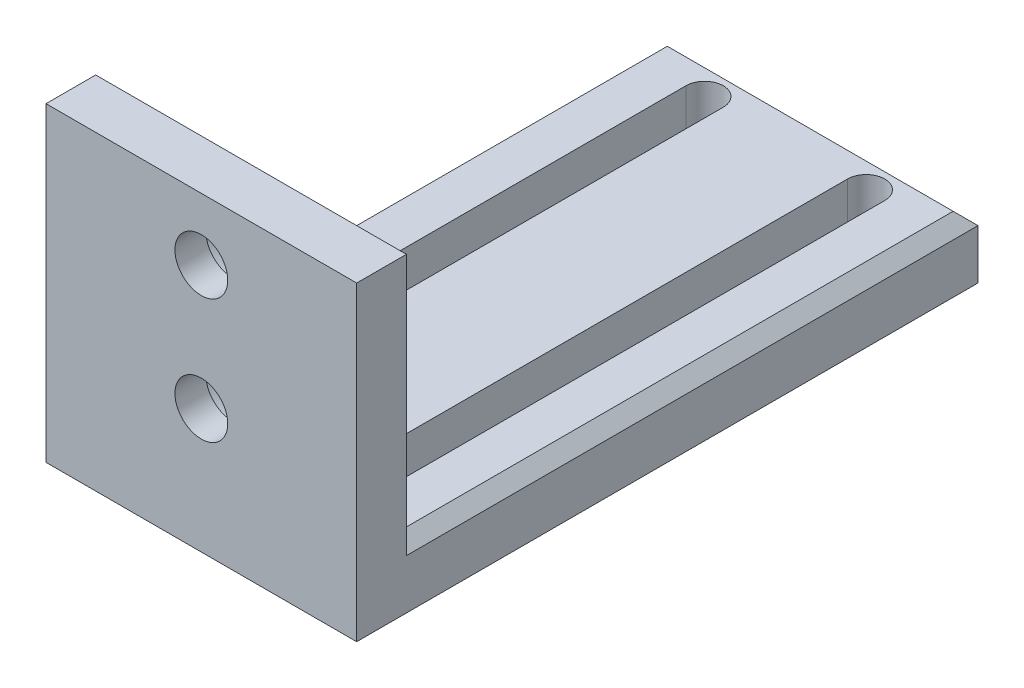
ISO-10303-21;
HEADER;
FILE_DESCRIPTION(('STEP AP214'),'2;1');
FILE_NAME('part.step','',(''),(''),'','','');
FILE_SCHEMA(('AUTOMOTIVE_DESIGN { 1 0 10303 214 1 1 1 1 }'));
ENDSEC;
DATA;
#1=APPLICATION_CONTEXT('core data for automotive mechanical design processes');
#2=APPLICATION_PROTOCOL_DEFINITION('international standard','automotive_design',2000,#1);
#3=PRODUCT_CONTEXT('',#1,'mechanical');
#4=PRODUCT('Part','Part','',(#3));
#5=PRODUCT_RELATED_PRODUCT_CATEGORY('part','',(#4));
#6=PRODUCT_DEFINITION_FORMATION('','',#4);
#7=PRODUCT_DEFINITION_CONTEXT('part definition',#1,'design');
#8=PRODUCT_DEFINITION('design','',#6,#7);
#9=PRODUCT_DEFINITION_SHAPE('','',#8);
#10=(LENGTH_UNIT() NAMED_UNIT(*) SI_UNIT(.MILLI.,.METRE.));
#11=(NAMED_UNIT(*) PLANE_ANGLE_UNIT() SI_UNIT($,.RADIAN.));
#12=(NAMED_UNIT(*) SI_UNIT($,.STERADIAN.) SOLID_ANGLE_UNIT());
#13=UNCERTAINTY_MEASURE_WITH_UNIT(LENGTH_MEASURE(1.E-05),#10,'distance_accuracy_value','');
#14=(GEOMETRIC_REPRESENTATION_CONTEXT(3) GLOBAL_UNCERTAINTY_ASSIGNED_CONTEXT((#13)) GLOBAL_UNIT_ASSIGNED_CONTEXT((#10,
#11,#12)) REPRESENTATION_CONTEXT('',''));
#15=CARTESIAN_POINT('',(0.,0.,0.));
#16=DIRECTION('',(0.,0.,1.));
#17=DIRECTION('',(1.,0.,0.));
#18=AXIS2_PLACEMENT_3D('',#15,#16,#17);
#19=CARTESIAN_POINT('',(25.,40.,10.));
#20=DIRECTION('',(0.,0.,-1.));
#21=DIRECTION('',(-1.,0.,0.));
#22=AXIS2_PLACEMENT_3D('',#19,#20,#21);
#23=CYLINDRICAL_SURFACE('',#22,4.25);
#24=CARTESIAN_POINT('',(25.,40.,10.));
#25=DIRECTION('',(0.,0.,1.));
#26=DIRECTION('',(1.,0.,0.));
#27=AXIS2_PLACEMENT_3D('',#24,#25,#26);
#28=CIRCLE('',#27,4.25);
#29=CARTESIAN_POINT('',(29.25,40.,10.));
#30=VERTEX_POINT('',#29);
#31=EDGE_CURVE('E194',#30,#30,#28,.T.);
#32=ORIENTED_EDGE('',*,*,#31,.T.);
#33=EDGE_LOOP('',(#32));
#34=FACE_BOUND('',#33,.T.);
#35=CARTESIAN_POINT('',(25.,40.,5.));
#36=DIRECTION('',(0.,0.,-1.));
#37=DIRECTION('',(-1.,0.,0.));
#38=AXIS2_PLACEMENT_3D('',#35,#36,#37);
#39=CIRCLE('',#38,4.25);
#40=CARTESIAN_POINT('',(20.75,40.,5.));
#41=VERTEX_POINT('',#40);
#42=EDGE_CURVE('E315',#41,#41,#39,.T.);
#43=ORIENTED_EDGE('',*,*,#42,.T.);
#44=EDGE_LOOP('',(#43));
#45=FACE_BOUND('',#44,.T.);
#46=ADVANCED_FACE('F43',(#34,#45),#23,.F.);
#47=CARTESIAN_POINT('',(25.,20.,10.));
#48=DIRECTION('',(0.,0.,-1.));
#49=DIRECTION('',(-1.,0.,0.));
#50=AXIS2_PLACEMENT_3D('',#47,#48,#49);
#51=CYLINDRICAL_SURFACE('',#50,4.25);
#52=CARTESIAN_POINT('',(25.,20.,10.));
#53=DIRECTION('',(0.,0.,1.));
#54=DIRECTION('',(1.,0.,0.));
#55=AXIS2_PLACEMENT_3D('',#52,#53,#54);
#56=CIRCLE('',#55,4.25);
#57=CARTESIAN_POINT('',(29.25,20.,10.));
#58=VERTEX_POINT('',#57);
#59=EDGE_CURVE('E320',#58,#58,#56,.T.);
#60=ORIENTED_EDGE('',*,*,#59,.T.);
#61=EDGE_LOOP('',(#60));
#62=FACE_BOUND('',#61,.T.);
#63=CARTESIAN_POINT('',(25.,20.,5.));
#64=DIRECTION('',(0.,0.,-1.));
#65=DIRECTION('',(-1.,0.,0.));
#66=AXIS2_PLACEMENT_3D('',#63,#64,#65);
#67=CIRCLE('',#66,4.25);
#68=CARTESIAN_POINT('',(20.75,20.,5.));
#69=VERTEX_POINT('',#68);
#70=EDGE_CURVE('E311',#69,#69,#67,.T.);
#71=ORIENTED_EDGE('',*,*,#70,.T.);
#72=EDGE_LOOP('',(#71));
#73=FACE_BOUND('',#72,.T.);
#74=ADVANCED_FACE('F460',(#62,#73),#51,.F.);
#75=CARTESIAN_POINT('',(0.,10.,0.));
#76=DIRECTION('',(0.,-1.,0.));
#77=DIRECTION('',(0.,0.,-1.));
#78=AXIS2_PLACEMENT_3D('',#75,#76,#77);
#79=PLANE('',#78);
#80=CARTESIAN_POINT('',(12.,10.,-6.));
#81=DIRECTION('',(0.,1.,0.));
#82=DIRECTION('',(0.,0.,1.));
#83=AXIS2_PLACEMENT_3D('',#80,#81,#82);
#84=CIRCLE('',#83,3.);
#85=CARTESIAN_POINT('',(9.,10.,-6.));
#86=VERTEX_POINT('',#85);
#87=CARTESIAN_POINT('',(15.,10.,-6.));
#88=VERTEX_POINT('',#87);
#89=EDGE_CURVE('E249',#86,#88,#84,.T.);
#90=ORIENTED_EDGE('',*,*,#89,.F.);
#91=DIRECTION('',(0.,0.,1.));
#92=VECTOR('',#91,1.);
#93=CARTESIAN_POINT('',(9.,10.,-6.));
#94=LINE('',#93,#92);
#95=CARTESIAN_POINT('',(9.,10.,-84.));
#96=VERTEX_POINT('',#95);
#97=EDGE_CURVE('E260',#96,#86,#94,.T.);
#98=ORIENTED_EDGE('',*,*,#97,.F.);
#99=CARTESIAN_POINT('',(12.,10.,-84.));
#100=DIRECTION('',(0.,1.,0.));
#101=DIRECTION('',(0.,0.,1.));
#102=AXIS2_PLACEMENT_3D('',#99,#100,#101);
#103=CIRCLE('',#102,3.);
#104=CARTESIAN_POINT('',(15.,10.,-84.));
#105=VERTEX_POINT('',#104);
#106=EDGE_CURVE('E256',#105,#96,#103,.T.);
#107=ORIENTED_EDGE('',*,*,#106,.F.);
#108=DIRECTION('',(0.,0.,-1.));
#109=VECTOR('',#108,1.);
#110=CARTESIAN_POINT('',(15.,10.,-6.));
#111=LINE('',#110,#109);
#112=EDGE_CURVE('E252',#88,#105,#111,.T.);
#113=ORIENTED_EDGE('',*,*,#112,.F.);
#114=EDGE_LOOP('',(#90,#98,#107,#113));
#115=FACE_BOUND('',#114,.T.);
#116=DIRECTION('',(1.,0.,0.));
#117=VECTOR('',#116,1.);
#118=CARTESIAN_POINT('',(0.,10.,0.));
#119=LINE('',#118,#117);
#120=CARTESIAN_POINT('',(2.,10.,0.));
#121=VERTEX_POINT('',#120);
#122=CARTESIAN_POINT('',(48.,10.,0.));
#123=VERTEX_POINT('',#122);
#124=EDGE_CURVE('E292',#121,#123,#119,.T.);
#125=ORIENTED_EDGE('',*,*,#124,.T.);
#126=DIRECTION('',(0.,0.,-1.));
#127=VECTOR('',#126,1.);
#128=CARTESIAN_POINT('',(48.,10.,0.));
#129=LINE('',#128,#127);
#130=CARTESIAN_POINT('',(48.,10.,-88.));
#131=VERTEX_POINT('',#130);
#132=EDGE_CURVE('E54',#123,#131,#129,.T.);
#133=ORIENTED_EDGE('',*,*,#132,.T.);
#134=DIRECTION('',(-1.,0.,0.));
#135=VECTOR('',#134,1.);
#136=CARTESIAN_POINT('',(0.,10.,-88.));
#137=LINE('',#136,#135);
#138=CARTESIAN_POINT('',(2.,10.,-88.));
#139=VERTEX_POINT('',#138);
#140=EDGE_CURVE('E66',#131,#139,#137,.T.);
#141=ORIENTED_EDGE('',*,*,#140,.T.);
#142=DIRECTION('',(0.,0.,1.));
#143=VECTOR('',#142,1.);
#144=CARTESIAN_POINT('',(2.,10.,0.));
#145=LINE('',#144,#143);
#146=EDGE_CURVE('E351',#139,#121,#145,.T.);
#147=ORIENTED_EDGE('',*,*,#146,.T.);
#148=EDGE_LOOP('',(#125,#133,#141,#147));
#149=FACE_BOUND('',#148,.T.);
#150=CARTESIAN_POINT('',(38.,10.,-6.00000000000001));
#151=DIRECTION('',(0.,1.,0.));
#152=DIRECTION('',(0.,0.,1.));
#153=AXIS2_PLACEMENT_3D('',#150,#151,#152);
#154=CIRCLE('',#153,3.);
#155=CARTESIAN_POINT('',(35.,10.,-6.00000000000001));
#156=VERTEX_POINT('',#155);
#157=CARTESIAN_POINT('',(41.,10.,-6.00000000000001));
#158=VERTEX_POINT('',#157);
#159=EDGE_CURVE('E210',#156,#158,#154,.T.);
#160=ORIENTED_EDGE('',*,*,#159,.F.);
#161=DIRECTION('',(0.,0.,1.));
#162=VECTOR('',#161,1.);
#163=CARTESIAN_POINT('',(35.,10.,-6.00000000000001));
#164=LINE('',#163,#162);
#165=CARTESIAN_POINT('',(35.,10.,-84.));
#166=VERTEX_POINT('',#165);
#167=EDGE_CURVE('E221',#166,#156,#164,.T.);
#168=ORIENTED_EDGE('',*,*,#167,.F.);
#169=CARTESIAN_POINT('',(38.,10.,-84.));
#170=DIRECTION('',(0.,1.,0.));
#171=DIRECTION('',(0.,0.,1.));
#172=AXIS2_PLACEMENT_3D('',#169,#170,#171);
#173=CIRCLE('',#172,3.);
#174=CARTESIAN_POINT('',(41.,10.,-84.));
#175=VERTEX_POINT('',#174);
#176=EDGE_CURVE('E217',#175,#166,#173,.T.);
#177=ORIENTED_EDGE('',*,*,#176,.F.);
#178=DIRECTION('',(0.,0.,-1.));
#179=VECTOR('',#178,1.);
#180=CARTESIAN_POINT('',(41.,10.,-6.00000000000001));
#181=LINE('',#180,#179);
#182=EDGE_CURVE('E213',#158,#175,#181,.T.);
#183=ORIENTED_EDGE('',*,*,#182,.F.);
#184=EDGE_LOOP('',(#160,#168,#177,#183));
#185=FACE_BOUND('',#184,.T.);
#186=ADVANCED_FACE('F440',(#115,#149,#185),#79,.F.);
#187=CARTESIAN_POINT('',(0.,0.,0.));
#188=DIRECTION('',(0.,-1.,0.));
#189=DIRECTION('',(0.,0.,-1.));
#190=AXIS2_PLACEMENT_3D('',#187,#188,#189);
#191=PLANE('',#190);
#192=DIRECTION('',(0.,0.,1.));
#193=VECTOR('',#192,1.);
#194=CARTESIAN_POINT('',(0.,0.,0.));
#195=LINE('',#194,#193);
#196=CARTESIAN_POINT('',(0.,0.,-90.));
#197=VERTEX_POINT('',#196);
#198=CARTESIAN_POINT('',(0.,0.,10.));
#199=VERTEX_POINT('',#198);
#200=EDGE_CURVE('E291',#197,#199,#195,.T.);
#201=ORIENTED_EDGE('',*,*,#200,.F.);
#202=DIRECTION('',(-1.,0.,0.));
#203=VECTOR('',#202,1.);
#204=CARTESIAN_POINT('',(0.,0.,-90.));
#205=LINE('',#204,#203);
#206=CARTESIAN_POINT('',(50.,0.,-90.));
#207=VERTEX_POINT('',#206);
#208=EDGE_CURVE('E296',#207,#197,#205,.T.);
#209=ORIENTED_EDGE('',*,*,#208,.F.);
#210=DIRECTION('',(0.,0.,-1.));
#211=VECTOR('',#210,1.);
#212=CARTESIAN_POINT('',(50.,0.,0.));
#213=LINE('',#212,#211);
#214=CARTESIAN_POINT('',(50.,0.,10.));
#215=VERTEX_POINT('',#214);
#216=EDGE_CURVE('E299',#215,#207,#213,.T.);
#217=ORIENTED_EDGE('',*,*,#216,.F.);
#218=DIRECTION('',(1.,0.,0.));
#219=VECTOR('',#218,1.);
#220=CARTESIAN_POINT('',(50.,0.,10.));
#221=LINE('',#220,#219);
#222=EDGE_CURVE('E190',#199,#215,#221,.T.);
#223=ORIENTED_EDGE('',*,*,#222,.F.);
#224=EDGE_LOOP('',(#201,#209,#217,#223));
#225=FACE_BOUND('',#224,.T.);
#226=DIRECTION('',(0.,0.,1.));
#227=VECTOR('',#226,1.);
#228=CARTESIAN_POINT('',(9.,0.,-6.));
#229=LINE('',#228,#227);
#230=CARTESIAN_POINT('',(9.,0.,-84.));
#231=VERTEX_POINT('',#230);
#232=CARTESIAN_POINT('',(9.,0.,-6.));
#233=VERTEX_POINT('',#232);
#234=EDGE_CURVE('E253',#231,#233,#229,.T.);
#235=ORIENTED_EDGE('',*,*,#234,.T.);
#236=CARTESIAN_POINT('',(12.,0.,-6.));
#237=DIRECTION('',(0.,1.,0.));
#238=DIRECTION('',(0.,0.,1.));
#239=AXIS2_PLACEMENT_3D('',#236,#237,#238);
#240=CIRCLE('',#239,3.);
#241=CARTESIAN_POINT('',(15.,0.,-6.));
#242=VERTEX_POINT('',#241);
#243=EDGE_CURVE('E248',#233,#242,#240,.T.);
#244=ORIENTED_EDGE('',*,*,#243,.T.);
#245=DIRECTION('',(0.,0.,-1.));
#246=VECTOR('',#245,1.);
#247=CARTESIAN_POINT('',(15.,0.,-6.));
#248=LINE('',#247,#246);
#249=CARTESIAN_POINT('',(15.,0.,-84.));
#250=VERTEX_POINT('',#249);
#251=EDGE_CURVE('E267',#242,#250,#248,.T.);
#252=ORIENTED_EDGE('',*,*,#251,.T.);
#253=CARTESIAN_POINT('',(12.,0.,-84.));
#254=DIRECTION('',(0.,1.,0.));
#255=DIRECTION('',(0.,0.,1.));
#256=AXIS2_PLACEMENT_3D('',#253,#254,#255);
#257=CIRCLE('',#256,3.);
#258=EDGE_CURVE('E271',#250,#231,#257,.T.);
#259=ORIENTED_EDGE('',*,*,#258,.T.);
#260=EDGE_LOOP('',(#235,#244,#252,#259));
#261=FACE_BOUND('',#260,.T.);
#262=DIRECTION('',(0.,0.,1.));
#263=VECTOR('',#262,1.);
#264=CARTESIAN_POINT('',(35.,0.,-6.00000000000001));
#265=LINE('',#264,#263);
#266=CARTESIAN_POINT('',(35.,0.,-84.));
#267=VERTEX_POINT('',#266);
#268=CARTESIAN_POINT('',(35.,0.,-6.00000000000001));
#269=VERTEX_POINT('',#268);
#270=EDGE_CURVE('E214',#267,#269,#265,.T.);
#271=ORIENTED_EDGE('',*,*,#270,.T.);
#272=CARTESIAN_POINT('',(38.,0.,-6.00000000000001));
#273=DIRECTION('',(0.,1.,0.));
#274=DIRECTION('',(0.,0.,1.));
#275=AXIS2_PLACEMENT_3D('',#272,#273,#274);
#276=CIRCLE('',#275,3.);
#277=CARTESIAN_POINT('',(41.,0.,-6.00000000000001));
#278=VERTEX_POINT('',#277);
#279=EDGE_CURVE('E200',#269,#278,#276,.T.);
#280=ORIENTED_EDGE('',*,*,#279,.T.);
#281=DIRECTION('',(0.,0.,-1.));
#282=VECTOR('',#281,1.);
#283=CARTESIAN_POINT('',(41.,0.,-6.00000000000001));
#284=LINE('',#283,#282);
#285=CARTESIAN_POINT('',(41.,0.,-84.));
#286=VERTEX_POINT('',#285);
#287=EDGE_CURVE('E205',#278,#286,#284,.T.);
#288=ORIENTED_EDGE('',*,*,#287,.T.);
#289=CARTESIAN_POINT('',(38.,0.,-84.));
#290=DIRECTION('',(0.,1.,0.));
#291=DIRECTION('',(0.,0.,1.));
#292=AXIS2_PLACEMENT_3D('',#289,#290,#291);
#293=CIRCLE('',#292,3.);
#294=EDGE_CURVE('E228',#286,#267,#293,.T.);
#295=ORIENTED_EDGE('',*,*,#294,.T.);
#296=EDGE_LOOP('',(#271,#280,#288,#295));
#297=FACE_BOUND('',#296,.T.);
#298=ADVANCED_FACE('F427',(#225,#261,#297),#191,.T.);
#299=CARTESIAN_POINT('',(0.,10.,0.));
#300=DIRECTION('',(1.,0.,0.));
#301=DIRECTION('',(0.,0.,-1.));
#302=AXIS2_PLACEMENT_3D('',#299,#300,#301);
#303=PLANE('',#302);
#304=DIRECTION('',(0.,0.,-1.));
#305=VECTOR('',#304,1.);
#306=CARTESIAN_POINT('',(0.,50.,10.));
#307=LINE('',#306,#305);
#308=CARTESIAN_POINT('',(0.,50.,10.));
#309=VERTEX_POINT('',#308);
#310=CARTESIAN_POINT('',(0.,50.,2.));
#311=VERTEX_POINT('',#310);
#312=EDGE_CURVE('E177',#309,#311,#307,.T.);
#313=ORIENTED_EDGE('',*,*,#312,.T.);
#314=DIRECTION('',(0.,-1.,0.));
#315=VECTOR('',#314,1.);
#316=CARTESIAN_POINT('',(0.,10.,2.00000000000003));
#317=LINE('',#316,#315);
#318=CARTESIAN_POINT('',(0.,7.99999999999997,2.00000000000003));
#319=VERTEX_POINT('',#318);
#320=EDGE_CURVE('E323',#311,#319,#317,.T.);
#321=ORIENTED_EDGE('',*,*,#320,.T.);
#322=DIRECTION('',(0.,0.,-1.));
#323=VECTOR('',#322,1.);
#324=CARTESIAN_POINT('',(0.,7.99999999999997,0.));
#325=LINE('',#324,#323);
#326=CARTESIAN_POINT('',(0.,7.99999999999997,-90.));
#327=VERTEX_POINT('',#326);
#328=EDGE_CURVE('E310',#319,#327,#325,.T.);
#329=ORIENTED_EDGE('',*,*,#328,.T.);
#330=DIRECTION('',(0.,-1.,0.));
#331=VECTOR('',#330,1.);
#332=CARTESIAN_POINT('',(0.,10.,-90.));
#333=LINE('',#332,#331);
#334=EDGE_CURVE('E295',#327,#197,#333,.T.);
#335=ORIENTED_EDGE('',*,*,#334,.T.);
#336=ORIENTED_EDGE('',*,*,#200,.T.);
#337=DIRECTION('',(0.,-1.,0.));
#338=VECTOR('',#337,1.);
#339=CARTESIAN_POINT('',(0.,0.,10.));
#340=LINE('',#339,#338);
#341=EDGE_CURVE('E182',#309,#199,#340,.T.);
#342=ORIENTED_EDGE('',*,*,#341,.F.);
#343=EDGE_LOOP('',(#313,#321,#329,#335,#336,#342));
#344=FACE_BOUND('',#343,.T.);
#345=ADVANCED_FACE('F424',(#344),#303,.F.);
#346=CARTESIAN_POINT('',(50.,10.,0.));
#347=DIRECTION('',(-1.,0.,0.));
#348=DIRECTION('',(0.,0.,1.));
#349=AXIS2_PLACEMENT_3D('',#346,#347,#348);
#350=PLANE('',#349);
#351=DIRECTION('',(0.,0.,1.));
#352=VECTOR('',#351,1.);
#353=CARTESIAN_POINT('',(50.,7.99999999999997,0.));
#354=LINE('',#353,#352);
#355=CARTESIAN_POINT('',(50.,7.99999999999997,-90.));
#356=VERTEX_POINT('',#355);
#357=CARTESIAN_POINT('',(50.,7.99999999999997,2.));
#358=VERTEX_POINT('',#357);
#359=EDGE_CURVE('E346',#356,#358,#354,.T.);
#360=ORIENTED_EDGE('',*,*,#359,.T.);
#361=DIRECTION('',(0.,1.,0.));
#362=VECTOR('',#361,1.);
#363=CARTESIAN_POINT('',(50.,10.,2.));
#364=LINE('',#363,#362);
#365=CARTESIAN_POINT('',(50.,50.,2.));
#366=VERTEX_POINT('',#365);
#367=EDGE_CURVE('E198',#358,#366,#364,.T.);
#368=ORIENTED_EDGE('',*,*,#367,.T.);
#369=DIRECTION('',(0.,0.,-1.));
#370=VECTOR('',#369,1.);
#371=CARTESIAN_POINT('',(50.,50.,10.));
#372=LINE('',#371,#370);
#373=CARTESIAN_POINT('',(50.,50.,10.));
#374=VERTEX_POINT('',#373);
#375=EDGE_CURVE('E174',#374,#366,#372,.T.);
#376=ORIENTED_EDGE('',*,*,#375,.F.);
#377=DIRECTION('',(0.,1.,0.));
#378=VECTOR('',#377,1.);
#379=CARTESIAN_POINT('',(50.,0.,10.));
#380=LINE('',#379,#378);
#381=EDGE_CURVE('E183',#215,#374,#380,.T.);
#382=ORIENTED_EDGE('',*,*,#381,.F.);
#383=ORIENTED_EDGE('',*,*,#216,.T.);
#384=DIRECTION('',(0.,-1.,0.));
#385=VECTOR('',#384,1.);
#386=CARTESIAN_POINT('',(50.,10.,-90.));
#387=LINE('',#386,#385);
#388=EDGE_CURVE('E307',#356,#207,#387,.T.);
#389=ORIENTED_EDGE('',*,*,#388,.F.);
#390=EDGE_LOOP('',(#360,#368,#376,#382,#383,#389));
#391=FACE_BOUND('',#390,.T.);
#392=ADVANCED_FACE('F196',(#391),#350,.F.);
#393=CARTESIAN_POINT('',(0.,10.,-90.));
#394=DIRECTION('',(0.,0.,1.));
#395=DIRECTION('',(1.,0.,0.));
#396=AXIS2_PLACEMENT_3D('',#393,#394,#395);
#397=PLANE('',#396);
#398=ORIENTED_EDGE('',*,*,#334,.F.);
#399=DIRECTION('',(1.,0.,0.));
#400=VECTOR('',#399,1.);
#401=CARTESIAN_POINT('',(0.,7.99999999999997,-90.));
#402=LINE('',#401,#400);
#403=EDGE_CURVE('E11',#327,#356,#402,.T.);
#404=ORIENTED_EDGE('',*,*,#403,.T.);
#405=ORIENTED_EDGE('',*,*,#388,.T.);
#406=ORIENTED_EDGE('',*,*,#208,.T.);
#407=EDGE_LOOP('',(#398,#404,#405,#406));
#408=FACE_BOUND('',#407,.T.);
#409=ADVANCED_FACE('F446',(#408),#397,.F.);
#410=CARTESIAN_POINT('',(12.,10.,-6.));
#411=DIRECTION('',(0.,-1.,0.));
#412=DIRECTION('',(0.,0.,-1.));
#413=AXIS2_PLACEMENT_3D('',#410,#411,#412);
#414=CYLINDRICAL_SURFACE('',#413,3.);
#415=ORIENTED_EDGE('',*,*,#243,.F.);
#416=DIRECTION('',(0.,-1.,0.));
#417=VECTOR('',#416,1.);
#418=CARTESIAN_POINT('',(9.,10.,-6.));
#419=LINE('',#418,#417);
#420=EDGE_CURVE('E263',#86,#233,#419,.T.);
#421=ORIENTED_EDGE('',*,*,#420,.F.);
#422=ORIENTED_EDGE('',*,*,#89,.T.);
#423=DIRECTION('',(0.,-1.,0.));
#424=VECTOR('',#423,1.);
#425=CARTESIAN_POINT('',(15.,10.,-6.));
#426=LINE('',#425,#424);
#427=EDGE_CURVE('E287',#88,#242,#426,.T.);
#428=ORIENTED_EDGE('',*,*,#427,.T.);
#429=EDGE_LOOP('',(#415,#421,#422,#428));
#430=FACE_BOUND('',#429,.T.);
#431=ADVANCED_FACE('F448',(#430),#414,.F.);
#432=CARTESIAN_POINT('',(15.,10.,-6.));
#433=DIRECTION('',(-1.,0.,0.));
#434=DIRECTION('',(0.,0.,1.));
#435=AXIS2_PLACEMENT_3D('',#432,#433,#434);
#436=PLANE('',#435);
#437=ORIENTED_EDGE('',*,*,#251,.F.);
#438=ORIENTED_EDGE('',*,*,#427,.F.);
#439=ORIENTED_EDGE('',*,*,#112,.T.);
#440=DIRECTION('',(0.,-1.,0.));
#441=VECTOR('',#440,1.);
#442=CARTESIAN_POINT('',(15.,10.,-84.));
#443=LINE('',#442,#441);
#444=EDGE_CURVE('E284',#105,#250,#443,.T.);
#445=ORIENTED_EDGE('',*,*,#444,.T.);
#446=EDGE_LOOP('',(#437,#438,#439,#445));
#447=FACE_BOUND('',#446,.T.);
#448=ADVANCED_FACE('F454',(#447),#436,.T.);
#449=CARTESIAN_POINT('',(12.,10.,-84.));
#450=DIRECTION('',(0.,-1.,0.));
#451=DIRECTION('',(0.,0.,-1.));
#452=AXIS2_PLACEMENT_3D('',#449,#450,#451);
#453=CYLINDRICAL_SURFACE('',#452,3.);
#454=ORIENTED_EDGE('',*,*,#258,.F.);
#455=ORIENTED_EDGE('',*,*,#444,.F.);
#456=ORIENTED_EDGE('',*,*,#106,.T.);
#457=DIRECTION('',(0.,-1.,0.));
#458=VECTOR('',#457,1.);
#459=CARTESIAN_POINT('',(9.,10.,-84.));
#460=LINE('',#459,#458);
#461=EDGE_CURVE('E281',#96,#231,#460,.T.);
#462=ORIENTED_EDGE('',*,*,#461,.T.);
#463=EDGE_LOOP('',(#454,#455,#456,#462));
#464=FACE_BOUND('',#463,.T.);
#465=ADVANCED_FACE('F498',(#464),#453,.F.);
#466=CARTESIAN_POINT('',(9.,10.,-6.));
#467=DIRECTION('',(1.,0.,0.));
#468=DIRECTION('',(0.,0.,-1.));
#469=AXIS2_PLACEMENT_3D('',#466,#467,#468);
#470=PLANE('',#469);
#471=ORIENTED_EDGE('',*,*,#234,.F.);
#472=ORIENTED_EDGE('',*,*,#461,.F.);
#473=ORIENTED_EDGE('',*,*,#97,.T.);
#474=ORIENTED_EDGE('',*,*,#420,.T.);
#475=EDGE_LOOP('',(#471,#472,#473,#474));
#476=FACE_BOUND('',#475,.T.);
#477=ADVANCED_FACE('F494',(#476),#470,.T.);
#478=CARTESIAN_POINT('',(38.,10.,-6.00000000000001));
#479=DIRECTION('',(0.,-1.,0.));
#480=DIRECTION('',(0.,0.,-1.));
#481=AXIS2_PLACEMENT_3D('',#478,#479,#480);
#482=CYLINDRICAL_SURFACE('',#481,3.);
#483=ORIENTED_EDGE('',*,*,#279,.F.);
#484=DIRECTION('',(0.,-1.,0.));
#485=VECTOR('',#484,1.);
#486=CARTESIAN_POINT('',(35.,10.,-6.00000000000001));
#487=LINE('',#486,#485);
#488=EDGE_CURVE('E223',#156,#269,#487,.T.);
#489=ORIENTED_EDGE('',*,*,#488,.F.);
#490=ORIENTED_EDGE('',*,*,#159,.T.);
#491=DIRECTION('',(0.,-1.,0.));
#492=VECTOR('',#491,1.);
#493=CARTESIAN_POINT('',(41.,10.,-6.00000000000001));
#494=LINE('',#493,#492);
#495=EDGE_CURVE('E244',#158,#278,#494,.T.);
#496=ORIENTED_EDGE('',*,*,#495,.T.);
#497=EDGE_LOOP('',(#483,#489,#490,#496));
#498=FACE_BOUND('',#497,.T.);
#499=ADVANCED_FACE('F490',(#498),#482,.F.);
#500=CARTESIAN_POINT('',(41.,10.,-6.00000000000001));
#501=DIRECTION('',(-1.,0.,0.));
#502=DIRECTION('',(0.,0.,1.));
#503=AXIS2_PLACEMENT_3D('',#500,#501,#502);
#504=PLANE('',#503);
#505=ORIENTED_EDGE('',*,*,#287,.F.);
#506=ORIENTED_EDGE('',*,*,#495,.F.);
#507=ORIENTED_EDGE('',*,*,#182,.T.);
#508=DIRECTION('',(0.,-1.,0.));
#509=VECTOR('',#508,1.);
#510=CARTESIAN_POINT('',(41.,10.,-84.));
#511=LINE('',#510,#509);
#512=EDGE_CURVE('E241',#175,#286,#511,.T.);
#513=ORIENTED_EDGE('',*,*,#512,.T.);
#514=EDGE_LOOP('',(#505,#506,#507,#513));
#515=FACE_BOUND('',#514,.T.);
#516=ADVANCED_FACE('F486',(#515),#504,.T.);
#517=CARTESIAN_POINT('',(38.,10.,-84.));
#518=DIRECTION('',(0.,-1.,0.));
#519=DIRECTION('',(0.,0.,-1.));
#520=AXIS2_PLACEMENT_3D('',#517,#518,#519);
#521=CYLINDRICAL_SURFACE('',#520,3.);
#522=ORIENTED_EDGE('',*,*,#294,.F.);
#523=ORIENTED_EDGE('',*,*,#512,.F.);
#524=ORIENTED_EDGE('',*,*,#176,.T.);
#525=DIRECTION('',(0.,-1.,0.));
#526=VECTOR('',#525,1.);
#527=CARTESIAN_POINT('',(35.,10.,-84.));
#528=LINE('',#527,#526);
#529=EDGE_CURVE('E238',#166,#267,#528,.T.);
#530=ORIENTED_EDGE('',*,*,#529,.T.);
#531=EDGE_LOOP('',(#522,#523,#524,#530));
#532=FACE_BOUND('',#531,.T.);
#533=ADVANCED_FACE('F482',(#532),#521,.F.);
#534=CARTESIAN_POINT('',(35.,10.,-6.00000000000001));
#535=DIRECTION('',(1.,0.,0.));
#536=DIRECTION('',(0.,0.,-1.));
#537=AXIS2_PLACEMENT_3D('',#534,#535,#536);
#538=PLANE('',#537);
#539=ORIENTED_EDGE('',*,*,#270,.F.);
#540=ORIENTED_EDGE('',*,*,#529,.F.);
#541=ORIENTED_EDGE('',*,*,#167,.T.);
#542=ORIENTED_EDGE('',*,*,#488,.T.);
#543=EDGE_LOOP('',(#539,#540,#541,#542));
#544=FACE_BOUND('',#543,.T.);
#545=ADVANCED_FACE('F473',(#544),#538,.T.);
#546=CARTESIAN_POINT('',(0.,0.,10.));
#547=DIRECTION('',(0.,0.,1.));
#548=DIRECTION('',(1.,0.,0.));
#549=AXIS2_PLACEMENT_3D('',#546,#547,#548);
#550=PLANE('',#549);
#551=ORIENTED_EDGE('',*,*,#31,.F.);
#552=EDGE_LOOP('',(#551));
#553=FACE_BOUND('',#552,.T.);
#554=ORIENTED_EDGE('',*,*,#381,.T.);
#555=DIRECTION('',(-1.,0.,0.));
#556=VECTOR('',#555,1.);
#557=CARTESIAN_POINT('',(50.,50.,10.));
#558=LINE('',#557,#556);
#559=EDGE_CURVE('E170',#374,#309,#558,.T.);
#560=ORIENTED_EDGE('',*,*,#559,.T.);
#561=ORIENTED_EDGE('',*,*,#341,.T.);
#562=ORIENTED_EDGE('',*,*,#222,.T.);
#563=EDGE_LOOP('',(#554,#560,#561,#562));
#564=FACE_BOUND('',#563,.T.);
#565=ORIENTED_EDGE('',*,*,#59,.F.);
#566=EDGE_LOOP('',(#565));
#567=FACE_BOUND('',#566,.T.);
#568=ADVANCED_FACE('F187',(#553,#564,#567),#550,.T.);
#569=CARTESIAN_POINT('',(0.,0.,0.));
#570=DIRECTION('',(0.,0.,1.));
#571=DIRECTION('',(1.,0.,0.));
#572=AXIS2_PLACEMENT_3D('',#569,#570,#571);
#573=PLANE('',#572);
#574=ORIENTED_EDGE('',*,*,#124,.F.);
#575=DIRECTION('',(0.,1.,0.));
#576=VECTOR('',#575,1.);
#577=CARTESIAN_POINT('',(2.,0.,0.));
#578=LINE('',#577,#576);
#579=CARTESIAN_POINT('',(2.,48.,0.));
#580=VERTEX_POINT('',#579);
#581=EDGE_CURVE('E336',#121,#580,#578,.T.);
#582=ORIENTED_EDGE('',*,*,#581,.T.);
#583=DIRECTION('',(1.,0.,0.));
#584=VECTOR('',#583,1.);
#585=CARTESIAN_POINT('',(0.,48.,0.));
#586=LINE('',#585,#584);
#587=CARTESIAN_POINT('',(22.1277186767309,48.,0.));
#588=VERTEX_POINT('',#587);
#589=EDGE_CURVE('E333',#580,#588,#586,.T.);
#590=ORIENTED_EDGE('',*,*,#589,.T.);
#591=CARTESIAN_POINT('',(25.,40.,0.));
#592=DIRECTION('',(0.,0.,-1.));
#593=DIRECTION('',(-1.,0.,0.));
#594=AXIS2_PLACEMENT_3D('',#591,#592,#593);
#595=CIRCLE('',#594,8.5);
#596=CARTESIAN_POINT('',(27.8722813232691,48.,0.));
#597=VERTEX_POINT('',#596);
#598=EDGE_CURVE('E390',#597,#588,#595,.T.);
#599=ORIENTED_EDGE('',*,*,#598,.F.);
#600=DIRECTION('',(1.,0.,0.));
#601=VECTOR('',#600,1.);
#602=CARTESIAN_POINT('',(0.,48.,0.));
#603=LINE('',#602,#601);
#604=CARTESIAN_POINT('',(48.,48.,0.));
#605=VERTEX_POINT('',#604);
#606=EDGE_CURVE('E330',#597,#605,#603,.T.);
#607=ORIENTED_EDGE('',*,*,#606,.T.);
#608=DIRECTION('',(0.,-1.,0.));
#609=VECTOR('',#608,1.);
#610=CARTESIAN_POINT('',(48.,0.,0.));
#611=LINE('',#610,#609);
#612=EDGE_CURVE('E327',#605,#123,#611,.T.);
#613=ORIENTED_EDGE('',*,*,#612,.T.);
#614=EDGE_LOOP('',(#574,#582,#590,#599,#607,#613));
#615=FACE_BOUND('',#614,.T.);
#616=CARTESIAN_POINT('',(25.,20.,0.));
#617=DIRECTION('',(0.,0.,-1.));
#618=DIRECTION('',(-1.,0.,0.));
#619=AXIS2_PLACEMENT_3D('',#616,#617,#618);
#620=CIRCLE('',#619,8.5);
#621=CARTESIAN_POINT('',(16.5,20.,0.));
#622=VERTEX_POINT('',#621);
#623=EDGE_CURVE('E378',#622,#622,#620,.T.);
#624=ORIENTED_EDGE('',*,*,#623,.F.);
#625=EDGE_LOOP('',(#624));
#626=FACE_BOUND('',#625,.T.);
#627=ADVANCED_FACE('F419',(#615,#626),#573,.F.);
#628=CARTESIAN_POINT('',(50.,50.,10.));
#629=DIRECTION('',(0.,-1.,0.));
#630=DIRECTION('',(1.,0.,0.));
#631=AXIS2_PLACEMENT_3D('',#628,#629,#630);
#632=PLANE('',#631);
#633=ORIENTED_EDGE('',*,*,#375,.T.);
#634=DIRECTION('',(-1.,0.,0.));
#635=VECTOR('',#634,1.);
#636=CARTESIAN_POINT('',(50.,50.,2.));
#637=LINE('',#636,#635);
#638=EDGE_CURVE('E340',#366,#311,#637,.T.);
#639=ORIENTED_EDGE('',*,*,#638,.T.);
#640=ORIENTED_EDGE('',*,*,#312,.F.);
#641=ORIENTED_EDGE('',*,*,#559,.F.);
#642=EDGE_LOOP('',(#633,#639,#640,#641));
#643=FACE_BOUND('',#642,.T.);
#644=ADVANCED_FACE('F172',(#643),#632,.F.);
#645=CARTESIAN_POINT('',(25.,20.,5.));
#646=DIRECTION('',(0.,0.,-1.));
#647=DIRECTION('',(-1.,0.,0.));
#648=AXIS2_PLACEMENT_3D('',#645,#646,#647);
#649=CYLINDRICAL_SURFACE('',#648,8.5);
#650=CARTESIAN_POINT('',(25.,20.,5.));
#651=DIRECTION('',(0.,0.,-1.));
#652=DIRECTION('',(-1.,0.,0.));
#653=AXIS2_PLACEMENT_3D('',#650,#651,#652);
#654=CIRCLE('',#653,8.5);
#655=CARTESIAN_POINT('',(16.5,20.,5.));
#656=VERTEX_POINT('',#655);
#657=EDGE_CURVE('E384',#656,#656,#654,.T.);
#658=ORIENTED_EDGE('',*,*,#657,.F.);
#659=EDGE_LOOP('',(#658));
#660=FACE_BOUND('',#659,.T.);
#661=ORIENTED_EDGE('',*,*,#623,.T.);
#662=EDGE_LOOP('',(#661));
#663=FACE_BOUND('',#662,.T.);
#664=ADVANCED_FACE('F479',(#660,#663),#649,.F.);
#665=CARTESIAN_POINT('',(25.,20.,5.));
#666=DIRECTION('',(0.,0.,-1.));
#667=DIRECTION('',(-1.,0.,0.));
#668=AXIS2_PLACEMENT_3D('',#665,#666,#667);
#669=PLANE('',#668);
#670=ORIENTED_EDGE('',*,*,#70,.F.);
#671=EDGE_LOOP('',(#670));
#672=FACE_BOUND('',#671,.T.);
#673=ORIENTED_EDGE('',*,*,#657,.T.);
#674=EDGE_LOOP('',(#673));
#675=FACE_BOUND('',#674,.T.);
#676=ADVANCED_FACE('F551',(#672,#675),#669,.T.);
#677=CARTESIAN_POINT('',(25.,40.,5.));
#678=DIRECTION('',(0.,0.,-1.));
#679=DIRECTION('',(-1.,0.,0.));
#680=AXIS2_PLACEMENT_3D('',#677,#678,#679);
#681=CYLINDRICAL_SURFACE('',#680,8.5);
#682=CARTESIAN_POINT('',(25.,40.,5.));
#683=DIRECTION('',(0.,0.,-1.));
#684=DIRECTION('',(-1.,0.,0.));
#685=AXIS2_PLACEMENT_3D('',#682,#683,#684);
#686=CIRCLE('',#685,8.5);
#687=CARTESIAN_POINT('',(16.5,40.,5.));
#688=VERTEX_POINT('',#687);
#689=EDGE_CURVE('E316',#688,#688,#686,.T.);
#690=ORIENTED_EDGE('',*,*,#689,.F.);
#691=EDGE_LOOP('',(#690));
#692=FACE_BOUND('',#691,.T.);
#693=ORIENTED_EDGE('',*,*,#598,.T.);
#694=CARTESIAN_POINT('',(25.,40.,-7.99999999999985));
#695=DIRECTION('',(0.,-0.707106781186542,0.707106781186552));
#696=DIRECTION('',(0.,-0.707106781186552,-0.707106781186543));
#697=AXIS2_PLACEMENT_3D('',#694,#695,#696);
#698=ELLIPSE('',#697,12.0208152801712,8.5);
#699=EDGE_CURVE('E343',#588,#597,#698,.F.);
#700=ORIENTED_EDGE('',*,*,#699,.T.);
#701=EDGE_LOOP('',(#693,#700));
#702=FACE_BOUND('',#701,.T.);
#703=ADVANCED_FACE('F410',(#692,#702),#681,.F.);
#704=CARTESIAN_POINT('',(25.,40.,5.));
#705=DIRECTION('',(0.,0.,-1.));
#706=DIRECTION('',(-1.,0.,0.));
#707=AXIS2_PLACEMENT_3D('',#704,#705,#706);
#708=PLANE('',#707);
#709=ORIENTED_EDGE('',*,*,#42,.F.);
#710=EDGE_LOOP('',(#709));
#711=FACE_BOUND('',#710,.T.);
#712=ORIENTED_EDGE('',*,*,#689,.T.);
#713=EDGE_LOOP('',(#712));
#714=FACE_BOUND('',#713,.T.);
#715=ADVANCED_FACE('F542',(#711,#714),#708,.T.);
#716=CARTESIAN_POINT('',(48.,10.,0.));
#717=DIRECTION('',(-0.707106781186552,-0.707106781186542,0.));
#718=DIRECTION('',(0.,0.,-1.));
#719=AXIS2_PLACEMENT_3D('',#716,#717,#718);
#720=PLANE('',#719);
#721=DIRECTION('',(0.577350269189623,-0.577350269189631,-0.577350269189623));
#722=VECTOR('',#721,1.);
#723=CARTESIAN_POINT('',(32.0000000000002,26.0000000000001,-72.0000000000001));
#724=LINE('',#723,#722);
#725=EDGE_CURVE('E371',#131,#356,#724,.T.);
#726=ORIENTED_EDGE('',*,*,#725,.F.);
#727=ORIENTED_EDGE('',*,*,#132,.F.);
#728=DIRECTION('',(0.577350269189626,-0.577350269189634,0.577350269189618));
#729=VECTOR('',#728,1.);
#730=CARTESIAN_POINT('',(49.3333333333333,8.66666666666667,1.33333333333333));
#731=LINE('',#730,#729);
#732=EDGE_CURVE('E48',#358,#123,#731,.F.);
#733=ORIENTED_EDGE('',*,*,#732,.F.);
#734=ORIENTED_EDGE('',*,*,#359,.F.);
#735=EDGE_LOOP('',(#726,#727,#733,#734));
#736=FACE_BOUND('',#735,.T.);
#737=ADVANCED_FACE('F46',(#736),#720,.F.);
#738=CARTESIAN_POINT('',(50.,10.,2.));
#739=DIRECTION('',(-0.707106781186542,0.,0.707106781186552));
#740=DIRECTION('',(0.,1.,0.));
#741=AXIS2_PLACEMENT_3D('',#738,#739,#740);
#742=PLANE('',#741);
#743=ORIENTED_EDGE('',*,*,#732,.T.);
#744=ORIENTED_EDGE('',*,*,#612,.F.);
#745=DIRECTION('',(0.577350269189628,0.577350269189629,0.57735026918962));
#746=VECTOR('',#745,1.);
#747=CARTESIAN_POINT('',(36.6666666666666,36.6666666666665,-11.3333333333333));
#748=LINE('',#747,#746);
#749=EDGE_CURVE('E368',#366,#605,#748,.F.);
#750=ORIENTED_EDGE('',*,*,#749,.F.);
#751=ORIENTED_EDGE('',*,*,#367,.F.);
#752=EDGE_LOOP('',(#743,#744,#750,#751));
#753=FACE_BOUND('',#752,.T.);
#754=ADVANCED_FACE('F421',(#753),#742,.F.);
#755=CARTESIAN_POINT('',(0.,10.,-88.));
#756=DIRECTION('',(0.,-0.707106781186542,0.707106781186552));
#757=DIRECTION('',(-1.,0.,0.));
#758=AXIS2_PLACEMENT_3D('',#755,#756,#757);
#759=PLANE('',#758);
#760=ORIENTED_EDGE('',*,*,#725,.T.);
#761=ORIENTED_EDGE('',*,*,#403,.F.);
#762=DIRECTION('',(-0.577350269189623,-0.577350269189631,-0.577350269189623));
#763=VECTOR('',#762,1.);
#764=CARTESIAN_POINT('',(31.3333333333331,39.3333333333335,-58.6666666666669));
#765=LINE('',#764,#763);
#766=EDGE_CURVE('E364',#139,#327,#765,.T.);
#767=ORIENTED_EDGE('',*,*,#766,.F.);
#768=ORIENTED_EDGE('',*,*,#140,.F.);
#769=EDGE_LOOP('',(#760,#761,#767,#768));
#770=FACE_BOUND('',#769,.T.);
#771=ADVANCED_FACE('F434',(#770),#759,.F.);
#772=CARTESIAN_POINT('',(50.,50.,2.));
#773=DIRECTION('',(0.,-0.707106781186542,0.707106781186552));
#774=DIRECTION('',(-1.,0.,0.));
#775=AXIS2_PLACEMENT_3D('',#772,#773,#774);
#776=PLANE('',#775);
#777=ORIENTED_EDGE('',*,*,#699,.F.);
#778=ORIENTED_EDGE('',*,*,#589,.F.);
#779=DIRECTION('',(-0.577350269189618,0.577350269189634,0.577350269189626));
#780=VECTOR('',#779,1.);
#781=CARTESIAN_POINT('',(16.6666666666662,33.3333333333333,-14.6666666666664));
#782=LINE('',#781,#780);
#783=EDGE_CURVE('E361',#311,#580,#782,.F.);
#784=ORIENTED_EDGE('',*,*,#783,.F.);
#785=ORIENTED_EDGE('',*,*,#638,.F.);
#786=ORIENTED_EDGE('',*,*,#749,.T.);
#787=ORIENTED_EDGE('',*,*,#606,.F.);
#788=EDGE_LOOP('',(#777,#778,#784,#785,#786,#787));
#789=FACE_BOUND('',#788,.T.);
#790=ADVANCED_FACE('F415',(#789),#776,.F.);
#791=CARTESIAN_POINT('',(2.,10.,0.));
#792=DIRECTION('',(0.707106781186552,-0.707106781186542,0.));
#793=DIRECTION('',(0.,0.,1.));
#794=AXIS2_PLACEMENT_3D('',#791,#792,#793);
#795=PLANE('',#794);
#796=ORIENTED_EDGE('',*,*,#766,.T.);
#797=ORIENTED_EDGE('',*,*,#328,.F.);
#798=DIRECTION('',(0.577350269189621,0.577350269189629,-0.577350269189629));
#799=VECTOR('',#798,1.);
#800=CARTESIAN_POINT('',(0.666666666666673,8.66666666666665,1.33333333333335));
#801=LINE('',#800,#799);
#802=EDGE_CURVE('E358',#121,#319,#801,.F.);
#803=ORIENTED_EDGE('',*,*,#802,.F.);
#804=ORIENTED_EDGE('',*,*,#146,.F.);
#805=EDGE_LOOP('',(#796,#797,#803,#804));
#806=FACE_BOUND('',#805,.T.);
#807=ADVANCED_FACE('F439',(#806),#795,.F.);
#808=CARTESIAN_POINT('',(0.,10.,2.00000000000003));
#809=DIRECTION('',(0.707106781186552,0.,0.707106781186542));
#810=DIRECTION('',(0.,-1.,0.));
#811=AXIS2_PLACEMENT_3D('',#808,#809,#810);
#812=PLANE('',#811);
#813=ORIENTED_EDGE('',*,*,#783,.T.);
#814=ORIENTED_EDGE('',*,*,#581,.F.);
#815=ORIENTED_EDGE('',*,*,#802,.T.);
#816=ORIENTED_EDGE('',*,*,#320,.F.);
#817=EDGE_LOOP('',(#813,#814,#815,#816));
#818=FACE_BOUND('',#817,.T.);
#819=ADVANCED_FACE('F444',(#818),#812,.F.);
#820=CLOSED_SHELL('',(#46,#74,#186,#298,#345,#392,#409,#431,#448,#465,#477,#499,#516,#533,#545,
#568,#627,#644,#664,#676,#703,#715,#737,#754,#771,#790,#807,#819));
#821=MANIFOLD_SOLID_BREP('B2',#820);
#822=ADVANCED_BREP_SHAPE_REPRESENTATION('',(#18,#821),#14);
#823=SHAPE_DEFINITION_REPRESENTATION(#9,#822);
ENDSEC;
END-ISO-10303-21;
